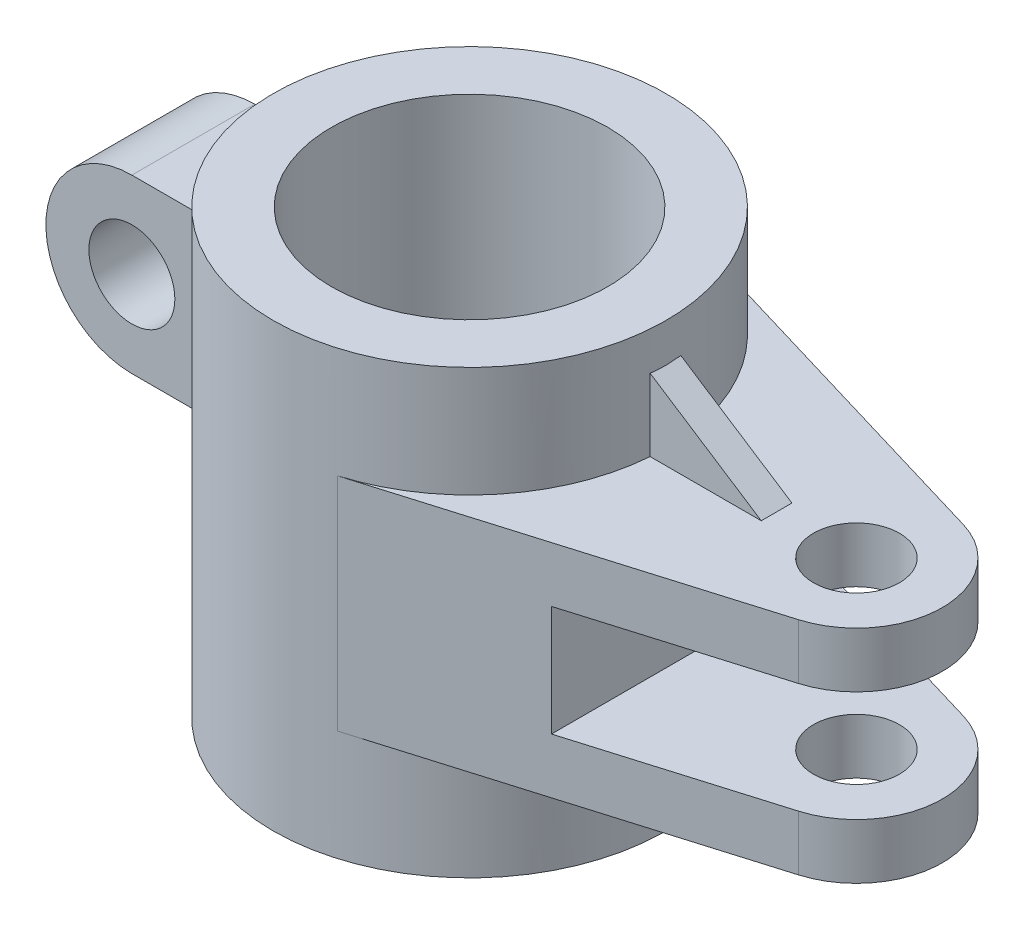
ISO-10303-21;
HEADER;
FILE_DESCRIPTION(('STEP AP214'),'2;1');
FILE_NAME('part.step','',(''),(''),'','','');
FILE_SCHEMA(('AUTOMOTIVE_DESIGN { 1 0 10303 214 1 1 1 1 }'));
ENDSEC;
DATA;
#1=APPLICATION_CONTEXT('core data for automotive mechanical design processes');
#2=APPLICATION_PROTOCOL_DEFINITION('international standard','automotive_design',2000,#1);
#3=PRODUCT_CONTEXT('',#1,'mechanical');
#4=PRODUCT('Part','Part','',(#3));
#5=PRODUCT_RELATED_PRODUCT_CATEGORY('part','',(#4));
#6=PRODUCT_DEFINITION_FORMATION('','',#4);
#7=PRODUCT_DEFINITION_CONTEXT('part definition',#1,'design');
#8=PRODUCT_DEFINITION('design','',#6,#7);
#9=PRODUCT_DEFINITION_SHAPE('','',#8);
#10=(LENGTH_UNIT() NAMED_UNIT(*) SI_UNIT(.MILLI.,.METRE.));
#11=(NAMED_UNIT(*) PLANE_ANGLE_UNIT() SI_UNIT($,.RADIAN.));
#12=(NAMED_UNIT(*) SI_UNIT($,.STERADIAN.) SOLID_ANGLE_UNIT());
#13=UNCERTAINTY_MEASURE_WITH_UNIT(LENGTH_MEASURE(1.E-05),#10,'distance_accuracy_value','');
#14=(GEOMETRIC_REPRESENTATION_CONTEXT(3) GLOBAL_UNCERTAINTY_ASSIGNED_CONTEXT((#13)) GLOBAL_UNIT_ASSIGNED_CONTEXT((#10,
#11,#12)) REPRESENTATION_CONTEXT('',''));
#15=CARTESIAN_POINT('',(0.,0.,0.));
#16=DIRECTION('',(0.,0.,1.));
#17=DIRECTION('',(1.,0.,0.));
#18=AXIS2_PLACEMENT_3D('',#15,#16,#17);
#19=CARTESIAN_POINT('',(0.,72.,0.));
#20=DIRECTION('',(0.,-1.,0.));
#21=DIRECTION('',(0.,0.,-1.));
#22=AXIS2_PLACEMENT_3D('',#19,#20,#21);
#23=CYLINDRICAL_SURFACE('',#22,32.);
#24=CARTESIAN_POINT('',(0.,72.,0.));
#25=DIRECTION('',(0.,1.,0.));
#26=DIRECTION('',(0.,0.,1.));
#27=AXIS2_PLACEMENT_3D('',#24,#25,#26);
#28=CIRCLE('',#27,32.);
#29=CARTESIAN_POINT('',(0.,72.,32.));
#30=VERTEX_POINT('',#29);
#31=EDGE_CURVE('E274',#30,#30,#28,.T.);
#32=ORIENTED_EDGE('',*,*,#31,.F.);
#33=EDGE_LOOP('',(#32));
#34=FACE_BOUND('',#33,.T.);
#35=CARTESIAN_POINT('',(0.,0.,0.));
#36=DIRECTION('',(0.,1.,0.));
#37=DIRECTION('',(0.,0.,1.));
#38=AXIS2_PLACEMENT_3D('',#35,#36,#37);
#39=CIRCLE('',#38,32.);
#40=CARTESIAN_POINT('',(0.,0.,32.));
#41=VERTEX_POINT('',#40);
#42=EDGE_CURVE('E271',#41,#41,#39,.T.);
#43=ORIENTED_EDGE('',*,*,#42,.T.);
#44=EDGE_LOOP('',(#43));
#45=FACE_BOUND('',#44,.T.);
#46=DIRECTION('',(0.,-1.,0.));
#47=VECTOR('',#46,1.);
#48=CARTESIAN_POINT('',(-30.3973683071413,72.,-10.));
#49=LINE('',#48,#47);
#50=CARTESIAN_POINT('',(-30.3973683071413,59.,-10.));
#51=VERTEX_POINT('',#50);
#52=CARTESIAN_POINT('',(-30.3973683071413,31.,-10.));
#53=VERTEX_POINT('',#52);
#54=EDGE_CURVE('E286',#51,#53,#49,.T.);
#55=ORIENTED_EDGE('',*,*,#54,.F.);
#56=CARTESIAN_POINT('',(0.,59.,0.));
#57=DIRECTION('',(0.,1.,0.));
#58=DIRECTION('',(0.,0.,1.));
#59=AXIS2_PLACEMENT_3D('',#56,#57,#58);
#60=CIRCLE('',#59,32.);
#61=CARTESIAN_POINT('',(-30.3973683071413,59.,10.));
#62=VERTEX_POINT('',#61);
#63=EDGE_CURVE('E292',#51,#62,#60,.T.);
#64=ORIENTED_EDGE('',*,*,#63,.T.);
#65=DIRECTION('',(0.,-1.,0.));
#66=VECTOR('',#65,1.);
#67=CARTESIAN_POINT('',(-30.3973683071413,72.,10.));
#68=LINE('',#67,#66);
#69=CARTESIAN_POINT('',(-30.3973683071413,31.,10.));
#70=VERTEX_POINT('',#69);
#71=EDGE_CURVE('E289',#70,#62,#68,.F.);
#72=ORIENTED_EDGE('',*,*,#71,.F.);
#73=CARTESIAN_POINT('',(0.,31.,0.));
#74=DIRECTION('',(0.,1.,0.));
#75=DIRECTION('',(0.,0.,1.));
#76=AXIS2_PLACEMENT_3D('',#73,#74,#75);
#77=CIRCLE('',#76,32.);
#78=EDGE_CURVE('E277',#53,#70,#77,.T.);
#79=ORIENTED_EDGE('',*,*,#78,.F.);
#80=EDGE_LOOP('',(#55,#64,#72,#79));
#81=FACE_BOUND('',#80,.T.);
#82=DIRECTION('',(0.,-1.,0.));
#83=VECTOR('',#82,1.);
#84=CARTESIAN_POINT('',(31.9021942818985,72.,2.5));
#85=LINE('',#84,#83);
#86=CARTESIAN_POINT('',(31.9021942818985,65.7528524535483,2.5));
#87=VERTEX_POINT('',#86);
#88=CARTESIAN_POINT('',(31.9021942818985,54.,2.5));
#89=VERTEX_POINT('',#88);
#90=EDGE_CURVE('E152',#87,#89,#85,.T.);
#91=ORIENTED_EDGE('',*,*,#90,.F.);
#92=CARTESIAN_POINT('',(0.,86.4703796598751,0.));
#93=DIRECTION('',(-0.544639035015022,-0.838670567945427,0.));
#94=DIRECTION('',(0.838670567945427,-0.544639035015022,0.));
#95=AXIS2_PLACEMENT_3D('',#92,#93,#94);
#96=ELLIPSE('',#95,38.1556253707502,32.);
#97=CARTESIAN_POINT('',(31.9021942818985,65.7528524535483,-2.5));
#98=VERTEX_POINT('',#97);
#99=EDGE_CURVE('E157',#98,#87,#96,.T.);
#100=ORIENTED_EDGE('',*,*,#99,.F.);
#101=DIRECTION('',(0.,-1.,0.));
#102=VECTOR('',#101,1.);
#103=CARTESIAN_POINT('',(31.9021942818985,72.,-2.5));
#104=LINE('',#103,#102);
#105=CARTESIAN_POINT('',(31.9021942818985,54.,-2.5));
#106=VERTEX_POINT('',#105);
#107=EDGE_CURVE('E163',#98,#106,#104,.T.);
#108=ORIENTED_EDGE('',*,*,#107,.T.);
#109=CARTESIAN_POINT('',(0.,54.,0.));
#110=DIRECTION('',(0.,-1.,0.));
#111=DIRECTION('',(0.,0.,-1.));
#112=AXIS2_PLACEMENT_3D('',#109,#110,#111);
#113=CIRCLE('',#112,32.);
#114=CARTESIAN_POINT('',(9.14285714285714,54.,-30.6660751199971));
#115=VERTEX_POINT('',#114);
#116=EDGE_CURVE('E233',#115,#106,#113,.T.);
#117=ORIENTED_EDGE('',*,*,#116,.F.);
#118=DIRECTION('',(0.,-1.,0.));
#119=VECTOR('',#118,1.);
#120=CARTESIAN_POINT('',(9.14285714285714,54.,-30.6660751199971));
#121=LINE('',#120,#119);
#122=CARTESIAN_POINT('',(9.14285714285713,18.,-30.6660751199971));
#123=VERTEX_POINT('',#122);
#124=EDGE_CURVE('E242',#115,#123,#121,.T.);
#125=ORIENTED_EDGE('',*,*,#124,.T.);
#126=CARTESIAN_POINT('',(0.,18.,0.));
#127=DIRECTION('',(0.,-1.,0.));
#128=DIRECTION('',(0.,0.,-1.));
#129=AXIS2_PLACEMENT_3D('',#126,#127,#128);
#130=CIRCLE('',#129,32.);
#131=CARTESIAN_POINT('',(9.14285714285714,18.,30.6660751199971));
#132=VERTEX_POINT('',#131);
#133=EDGE_CURVE('E228',#123,#132,#130,.T.);
#134=ORIENTED_EDGE('',*,*,#133,.T.);
#135=DIRECTION('',(0.,-1.,0.));
#136=VECTOR('',#135,1.);
#137=CARTESIAN_POINT('',(9.14285714285714,54.,30.6660751199971));
#138=LINE('',#137,#136);
#139=CARTESIAN_POINT('',(9.14285714285714,54.,30.6660751199971));
#140=VERTEX_POINT('',#139);
#141=EDGE_CURVE('E264',#140,#132,#138,.T.);
#142=ORIENTED_EDGE('',*,*,#141,.F.);
#143=EDGE_CURVE('E236',#89,#140,#113,.T.);
#144=ORIENTED_EDGE('',*,*,#143,.F.);
#145=EDGE_LOOP('',(#91,#100,#108,#117,#125,#134,#142,#144));
#146=FACE_BOUND('',#145,.T.);
#147=ADVANCED_FACE('F35',(#34,#45,#81,#146),#23,.T.);
#148=CARTESIAN_POINT('',(0.,54.,0.));
#149=DIRECTION('',(0.,-1.,0.));
#150=DIRECTION('',(0.,0.,-1.));
#151=AXIS2_PLACEMENT_3D('',#148,#149,#150);
#152=PLANE('',#151);
#153=CARTESIAN_POINT('',(63.,54.,0.));
#154=DIRECTION('',(0.,1.,0.));
#155=DIRECTION('',(0.,0.,1.));
#156=AXIS2_PLACEMENT_3D('',#153,#154,#155);
#157=CIRCLE('',#156,7.);
#158=CARTESIAN_POINT('',(63.,54.,7.));
#159=VERTEX_POINT('',#158);
#160=EDGE_CURVE('E225',#159,#159,#157,.T.);
#161=ORIENTED_EDGE('',*,*,#160,.F.);
#162=EDGE_LOOP('',(#161));
#163=FACE_BOUND('',#162,.T.);
#164=DIRECTION('',(1.,0.,0.));
#165=VECTOR('',#164,1.);
#166=CARTESIAN_POINT('',(0.,54.,2.5));
#167=LINE('',#166,#165);
#168=CARTESIAN_POINT('',(50.,54.,2.5));
#169=VERTEX_POINT('',#168);
#170=EDGE_CURVE('E11',#89,#169,#167,.T.);
#171=ORIENTED_EDGE('',*,*,#170,.F.);
#172=ORIENTED_EDGE('',*,*,#143,.T.);
#173=DIRECTION('',(0.95831484749991,0.,-0.285714285714285));
#174=VECTOR('',#173,1.);
#175=CARTESIAN_POINT('',(9.14285714285714,54.,30.6660751199971));
#176=LINE('',#175,#174);
#177=CARTESIAN_POINT('',(67.,54.,13.4164078649987));
#178=VERTEX_POINT('',#177);
#179=EDGE_CURVE('E235',#140,#178,#176,.T.);
#180=ORIENTED_EDGE('',*,*,#179,.T.);
#181=CARTESIAN_POINT('',(63.,54.,0.));
#182=DIRECTION('',(0.,1.,0.));
#183=DIRECTION('',(0.,0.,1.));
#184=AXIS2_PLACEMENT_3D('',#181,#182,#183);
#185=CIRCLE('',#184,14.);
#186=CARTESIAN_POINT('',(67.,54.,-13.4164078649987));
#187=VERTEX_POINT('',#186);
#188=EDGE_CURVE('E238',#178,#187,#185,.T.);
#189=ORIENTED_EDGE('',*,*,#188,.T.);
#190=DIRECTION('',(-0.95831484749991,0.,-0.285714285714285));
#191=VECTOR('',#190,1.);
#192=CARTESIAN_POINT('',(9.14285714285714,54.,-30.6660751199971));
#193=LINE('',#192,#191);
#194=EDGE_CURVE('E240',#187,#115,#193,.T.);
#195=ORIENTED_EDGE('',*,*,#194,.T.);
#196=ORIENTED_EDGE('',*,*,#116,.T.);
#197=DIRECTION('',(1.,0.,0.));
#198=VECTOR('',#197,1.);
#199=CARTESIAN_POINT('',(0.,54.,-2.5));
#200=LINE('',#199,#198);
#201=CARTESIAN_POINT('',(50.,54.,-2.5));
#202=VERTEX_POINT('',#201);
#203=EDGE_CURVE('E42',#106,#202,#200,.T.);
#204=ORIENTED_EDGE('',*,*,#203,.T.);
#205=DIRECTION('',(0.,0.,-1.));
#206=VECTOR('',#205,1.);
#207=CARTESIAN_POINT('',(50.,54.,2.5));
#208=LINE('',#207,#206);
#209=EDGE_CURVE('E49',#169,#202,#208,.T.);
#210=ORIENTED_EDGE('',*,*,#209,.F.);
#211=EDGE_LOOP('',(#171,#172,#180,#189,#195,#196,#204,#210));
#212=FACE_BOUND('',#211,.T.);
#213=ADVANCED_FACE('F161',(#163,#212),#152,.F.);
#214=CARTESIAN_POINT('',(-30.3305054874093,59.,10.));
#215=DIRECTION('',(0.,0.,-1.));
#216=DIRECTION('',(-1.,0.,0.));
#217=AXIS2_PLACEMENT_3D('',#214,#215,#216);
#218=PLANE('',#217);
#219=CARTESIAN_POINT('',(-45.,45.,9.99999999999999));
#220=DIRECTION('',(0.,0.,-1.));
#221=DIRECTION('',(-1.,0.,0.));
#222=AXIS2_PLACEMENT_3D('',#219,#220,#221);
#223=CIRCLE('',#222,7.);
#224=CARTESIAN_POINT('',(-52.,45.,10.));
#225=VERTEX_POINT('',#224);
#226=EDGE_CURVE('E183',#225,#225,#223,.T.);
#227=ORIENTED_EDGE('',*,*,#226,.T.);
#228=EDGE_LOOP('',(#227));
#229=FACE_BOUND('',#228,.T.);
#230=DIRECTION('',(1.,0.,0.));
#231=VECTOR('',#230,1.);
#232=CARTESIAN_POINT('',(-45.,59.,10.));
#233=LINE('',#232,#231);
#234=CARTESIAN_POINT('',(-45.,59.,9.99999999999999));
#235=VERTEX_POINT('',#234);
#236=EDGE_CURVE('E187',#235,#62,#233,.T.);
#237=ORIENTED_EDGE('',*,*,#236,.F.);
#238=CARTESIAN_POINT('',(-45.,45.,9.99999999999999));
#239=DIRECTION('',(0.,0.,-1.));
#240=DIRECTION('',(-1.,0.,0.));
#241=AXIS2_PLACEMENT_3D('',#238,#239,#240);
#242=CIRCLE('',#241,14.);
#243=CARTESIAN_POINT('',(-45.4248343700193,31.006447350367,10.));
#244=VERTEX_POINT('',#243);
#245=EDGE_CURVE('E178',#244,#235,#242,.T.);
#246=ORIENTED_EDGE('',*,*,#245,.F.);
#247=DIRECTION('',(-0.914920888233763,-0.403633210072639,0.));
#248=VECTOR('',#247,1.);
#249=CARTESIAN_POINT('',(-22.4518622668061,41.141372232047,9.99999999999999));
#250=LINE('',#249,#248);
#251=CARTESIAN_POINT('',(-45.4394486668049,31.,10.));
#252=VERTEX_POINT('',#251);
#253=EDGE_CURVE('E175',#244,#252,#250,.T.);
#254=ORIENTED_EDGE('',*,*,#253,.T.);
#255=DIRECTION('',(1.,0.,0.));
#256=VECTOR('',#255,1.);
#257=CARTESIAN_POINT('',(-30.3305054874093,31.,10.));
#258=LINE('',#257,#256);
#259=EDGE_CURVE('E186',#252,#70,#258,.T.);
#260=ORIENTED_EDGE('',*,*,#259,.T.);
#261=ORIENTED_EDGE('',*,*,#71,.T.);
#262=EDGE_LOOP('',(#237,#246,#254,#260,#261));
#263=FACE_BOUND('',#262,.T.);
#264=ADVANCED_FACE('F310',(#229,#263),#218,.F.);
#265=CARTESIAN_POINT('',(-45.,59.,-10.));
#266=DIRECTION('',(0.,0.,1.));
#267=DIRECTION('',(1.,0.,0.));
#268=AXIS2_PLACEMENT_3D('',#265,#266,#267);
#269=PLANE('',#268);
#270=CARTESIAN_POINT('',(-45.,45.,-10.));
#271=DIRECTION('',(0.,0.,1.));
#272=DIRECTION('',(1.,0.,0.));
#273=AXIS2_PLACEMENT_3D('',#270,#271,#272);
#274=CIRCLE('',#273,7.);
#275=CARTESIAN_POINT('',(-38.,45.,-10.));
#276=VERTEX_POINT('',#275);
#277=EDGE_CURVE('E181',#276,#276,#274,.T.);
#278=ORIENTED_EDGE('',*,*,#277,.T.);
#279=EDGE_LOOP('',(#278));
#280=FACE_BOUND('',#279,.T.);
#281=CARTESIAN_POINT('',(-45.,45.,-10.));
#282=DIRECTION('',(0.,0.,1.));
#283=DIRECTION('',(1.,0.,0.));
#284=AXIS2_PLACEMENT_3D('',#281,#282,#283);
#285=CIRCLE('',#284,14.);
#286=CARTESIAN_POINT('',(-45.,59.,-10.));
#287=VERTEX_POINT('',#286);
#288=CARTESIAN_POINT('',(-45.4248343700193,31.006447350367,-10.));
#289=VERTEX_POINT('',#288);
#290=EDGE_CURVE('E179',#287,#289,#285,.T.);
#291=ORIENTED_EDGE('',*,*,#290,.F.);
#292=DIRECTION('',(-1.,0.,0.));
#293=VECTOR('',#292,1.);
#294=CARTESIAN_POINT('',(-30.3305054874093,59.,-10.));
#295=LINE('',#294,#293);
#296=EDGE_CURVE('E189',#51,#287,#295,.T.);
#297=ORIENTED_EDGE('',*,*,#296,.F.);
#298=ORIENTED_EDGE('',*,*,#54,.T.);
#299=DIRECTION('',(-1.,0.,0.));
#300=VECTOR('',#299,1.);
#301=CARTESIAN_POINT('',(-45.,31.,-10.));
#302=LINE('',#301,#300);
#303=CARTESIAN_POINT('',(-45.4394486668049,31.,-10.));
#304=VERTEX_POINT('',#303);
#305=EDGE_CURVE('E190',#53,#304,#302,.T.);
#306=ORIENTED_EDGE('',*,*,#305,.T.);
#307=DIRECTION('',(0.914920888233763,0.403633210072639,0.));
#308=VECTOR('',#307,1.);
#309=CARTESIAN_POINT('',(-34.7314061327155,35.7240385887053,-10.));
#310=LINE('',#309,#308);
#311=EDGE_CURVE('E57',#304,#289,#310,.T.);
#312=ORIENTED_EDGE('',*,*,#311,.T.);
#313=EDGE_LOOP('',(#291,#297,#298,#306,#312));
#314=FACE_BOUND('',#313,.T.);
#315=ADVANCED_FACE('F319',(#280,#314),#269,.F.);
#316=CARTESIAN_POINT('',(0.,59.,0.));
#317=DIRECTION('',(0.,1.,0.));
#318=DIRECTION('',(0.,0.,1.));
#319=AXIS2_PLACEMENT_3D('',#316,#317,#318);
#320=PLANE('',#319);
#321=ORIENTED_EDGE('',*,*,#296,.T.);
#322=DIRECTION('',(0.,0.,1.));
#323=VECTOR('',#322,1.);
#324=CARTESIAN_POINT('',(-45.,59.,-32.));
#325=LINE('',#324,#323);
#326=EDGE_CURVE('E299',#287,#235,#325,.T.);
#327=ORIENTED_EDGE('',*,*,#326,.T.);
#328=ORIENTED_EDGE('',*,*,#236,.T.);
#329=ORIENTED_EDGE('',*,*,#63,.F.);
#330=EDGE_LOOP('',(#321,#327,#328,#329));
#331=FACE_BOUND('',#330,.T.);
#332=ADVANCED_FACE('F303',(#331),#320,.T.);
#333=CARTESIAN_POINT('',(9.14285714285714,54.,30.6660751199971));
#334=DIRECTION('',(-0.285714285714285,0.,-0.95831484749991));
#335=DIRECTION('',(-0.95831484749991,0.,0.285714285714286));
#336=AXIS2_PLACEMENT_3D('',#333,#334,#335);
#337=PLANE('',#336);
#338=DIRECTION('',(0.95831484749991,0.,-0.285714285714285));
#339=VECTOR('',#338,1.);
#340=CARTESIAN_POINT('',(36.,27.,22.6588221719979));
#341=LINE('',#340,#339);
#342=CARTESIAN_POINT('',(36.,27.,22.6588221719979));
#343=VERTEX_POINT('',#342);
#344=CARTESIAN_POINT('',(67.,27.,13.4164078649987));
#345=VERTEX_POINT('',#344);
#346=EDGE_CURVE('E204',#343,#345,#341,.T.);
#347=ORIENTED_EDGE('',*,*,#346,.F.);
#348=DIRECTION('',(0.,1.,0.));
#349=VECTOR('',#348,1.);
#350=CARTESIAN_POINT('',(36.,27.,22.6588221719979));
#351=LINE('',#350,#349);
#352=CARTESIAN_POINT('',(36.,45.,22.6588221719979));
#353=VERTEX_POINT('',#352);
#354=EDGE_CURVE('E219',#343,#353,#351,.T.);
#355=ORIENTED_EDGE('',*,*,#354,.T.);
#356=DIRECTION('',(0.95831484749991,0.,-0.285714285714285));
#357=VECTOR('',#356,1.);
#358=CARTESIAN_POINT('',(36.,45.,22.6588221719979));
#359=LINE('',#358,#357);
#360=CARTESIAN_POINT('',(67.,45.,13.4164078649987));
#361=VERTEX_POINT('',#360);
#362=EDGE_CURVE('E214',#353,#361,#359,.T.);
#363=ORIENTED_EDGE('',*,*,#362,.T.);
#364=DIRECTION('',(0.,-1.,0.));
#365=VECTOR('',#364,1.);
#366=CARTESIAN_POINT('',(67.,54.,13.4164078649987));
#367=LINE('',#366,#365);
#368=EDGE_CURVE('E261',#178,#361,#367,.T.);
#369=ORIENTED_EDGE('',*,*,#368,.F.);
#370=ORIENTED_EDGE('',*,*,#179,.F.);
#371=ORIENTED_EDGE('',*,*,#141,.T.);
#372=DIRECTION('',(0.95831484749991,0.,-0.285714285714285));
#373=VECTOR('',#372,1.);
#374=CARTESIAN_POINT('',(9.14285714285714,18.,30.6660751199971));
#375=LINE('',#374,#373);
#376=CARTESIAN_POINT('',(67.,18.,13.4164078649987));
#377=VERTEX_POINT('',#376);
#378=EDGE_CURVE('E245',#132,#377,#375,.T.);
#379=ORIENTED_EDGE('',*,*,#378,.T.);
#380=EDGE_CURVE('E260',#345,#377,#367,.T.);
#381=ORIENTED_EDGE('',*,*,#380,.F.);
#382=EDGE_LOOP('',(#347,#355,#363,#369,#370,#371,#379,#381));
#383=FACE_BOUND('',#382,.T.);
#384=ADVANCED_FACE('F362',(#383),#337,.F.);
#385=CARTESIAN_POINT('',(63.,54.,0.));
#386=DIRECTION('',(0.,-1.,0.));
#387=DIRECTION('',(0.,0.,-1.));
#388=AXIS2_PLACEMENT_3D('',#385,#386,#387);
#389=CYLINDRICAL_SURFACE('',#388,14.);
#390=CARTESIAN_POINT('',(63.,27.,0.));
#391=DIRECTION('',(0.,1.,0.));
#392=DIRECTION('',(0.,0.,1.));
#393=AXIS2_PLACEMENT_3D('',#390,#391,#392);
#394=CIRCLE('',#393,14.);
#395=CARTESIAN_POINT('',(67.,27.,-13.4164078649987));
#396=VERTEX_POINT('',#395);
#397=EDGE_CURVE('E206',#345,#396,#394,.T.);
#398=ORIENTED_EDGE('',*,*,#397,.F.);
#399=ORIENTED_EDGE('',*,*,#380,.T.);
#400=CARTESIAN_POINT('',(63.,18.,0.));
#401=DIRECTION('',(0.,1.,0.));
#402=DIRECTION('',(0.,0.,1.));
#403=AXIS2_PLACEMENT_3D('',#400,#401,#402);
#404=CIRCLE('',#403,14.);
#405=CARTESIAN_POINT('',(67.,18.,-13.4164078649987));
#406=VERTEX_POINT('',#405);
#407=EDGE_CURVE('E248',#377,#406,#404,.T.);
#408=ORIENTED_EDGE('',*,*,#407,.T.);
#409=DIRECTION('',(0.,-1.,0.));
#410=VECTOR('',#409,1.);
#411=CARTESIAN_POINT('',(67.,54.,-13.4164078649987));
#412=LINE('',#411,#410);
#413=EDGE_CURVE('E256',#396,#406,#412,.T.);
#414=ORIENTED_EDGE('',*,*,#413,.F.);
#415=EDGE_LOOP('',(#398,#399,#408,#414));
#416=FACE_BOUND('',#415,.T.);
#417=ADVANCED_FACE('F379',(#416),#389,.T.);
#418=CARTESIAN_POINT('',(9.14285714285714,54.,-30.6660751199971));
#419=DIRECTION('',(-0.285714285714285,0.,0.95831484749991));
#420=DIRECTION('',(0.95831484749991,0.,0.285714285714286));
#421=AXIS2_PLACEMENT_3D('',#418,#419,#420);
#422=PLANE('',#421);
#423=DIRECTION('',(-0.95831484749991,0.,-0.285714285714285));
#424=VECTOR('',#423,1.);
#425=CARTESIAN_POINT('',(36.,27.,-22.6588221719979));
#426=LINE('',#425,#424);
#427=CARTESIAN_POINT('',(36.,27.,-22.6588221719979));
#428=VERTEX_POINT('',#427);
#429=EDGE_CURVE('E197',#396,#428,#426,.T.);
#430=ORIENTED_EDGE('',*,*,#429,.F.);
#431=ORIENTED_EDGE('',*,*,#413,.T.);
#432=DIRECTION('',(-0.95831484749991,0.,-0.285714285714285));
#433=VECTOR('',#432,1.);
#434=CARTESIAN_POINT('',(9.14285714285714,18.,-30.6660751199971));
#435=LINE('',#434,#433);
#436=EDGE_CURVE('E251',#406,#123,#435,.T.);
#437=ORIENTED_EDGE('',*,*,#436,.T.);
#438=ORIENTED_EDGE('',*,*,#124,.F.);
#439=ORIENTED_EDGE('',*,*,#194,.F.);
#440=CARTESIAN_POINT('',(67.,45.,-13.4164078649987));
#441=VERTEX_POINT('',#440);
#442=EDGE_CURVE('E257',#187,#441,#412,.T.);
#443=ORIENTED_EDGE('',*,*,#442,.T.);
#444=DIRECTION('',(-0.95831484749991,0.,-0.285714285714285));
#445=VECTOR('',#444,1.);
#446=CARTESIAN_POINT('',(36.,45.,-22.6588221719979));
#447=LINE('',#446,#445);
#448=CARTESIAN_POINT('',(36.,45.,-22.6588221719979));
#449=VERTEX_POINT('',#448);
#450=EDGE_CURVE('E193',#441,#449,#447,.T.);
#451=ORIENTED_EDGE('',*,*,#450,.T.);
#452=DIRECTION('',(0.,1.,0.));
#453=VECTOR('',#452,1.);
#454=CARTESIAN_POINT('',(36.,27.,-22.6588221719979));
#455=LINE('',#454,#453);
#456=EDGE_CURVE('E208',#428,#449,#455,.T.);
#457=ORIENTED_EDGE('',*,*,#456,.F.);
#458=EDGE_LOOP('',(#430,#431,#437,#438,#439,#443,#451,#457));
#459=FACE_BOUND('',#458,.T.);
#460=ADVANCED_FACE('F370',(#459),#422,.F.);
#461=CARTESIAN_POINT('',(63.,54.,0.));
#462=DIRECTION('',(0.,-1.,0.));
#463=DIRECTION('',(0.,0.,-1.));
#464=AXIS2_PLACEMENT_3D('',#461,#462,#463);
#465=CYLINDRICAL_SURFACE('',#464,7.);
#466=CARTESIAN_POINT('',(63.,18.,0.));
#467=DIRECTION('',(0.,1.,0.));
#468=DIRECTION('',(0.,0.,1.));
#469=AXIS2_PLACEMENT_3D('',#466,#467,#468);
#470=CIRCLE('',#469,7.);
#471=CARTESIAN_POINT('',(63.,18.,7.));
#472=VERTEX_POINT('',#471);
#473=EDGE_CURVE('E229',#472,#472,#470,.T.);
#474=ORIENTED_EDGE('',*,*,#473,.F.);
#475=EDGE_LOOP('',(#474));
#476=FACE_BOUND('',#475,.T.);
#477=CARTESIAN_POINT('',(63.,27.,0.));
#478=DIRECTION('',(0.,1.,0.));
#479=DIRECTION('',(0.,0.,1.));
#480=AXIS2_PLACEMENT_3D('',#477,#478,#479);
#481=CIRCLE('',#480,7.);
#482=CARTESIAN_POINT('',(63.,27.,7.));
#483=VERTEX_POINT('',#482);
#484=EDGE_CURVE('E232',#483,#483,#481,.T.);
#485=ORIENTED_EDGE('',*,*,#484,.T.);
#486=EDGE_LOOP('',(#485));
#487=FACE_BOUND('',#486,.T.);
#488=ADVANCED_FACE('F365',(#476,#487),#465,.F.);
#489=CARTESIAN_POINT('',(0.,72.,0.));
#490=DIRECTION('',(0.,1.,0.));
#491=DIRECTION('',(0.,0.,1.));
#492=AXIS2_PLACEMENT_3D('',#489,#490,#491);
#493=PLANE('',#492);
#494=ORIENTED_EDGE('',*,*,#31,.T.);
#495=EDGE_LOOP('',(#494));
#496=FACE_BOUND('',#495,.T.);
#497=CARTESIAN_POINT('',(0.,72.,0.));
#498=DIRECTION('',(0.,1.,0.));
#499=DIRECTION('',(0.,0.,1.));
#500=AXIS2_PLACEMENT_3D('',#497,#498,#499);
#501=CIRCLE('',#500,22.5);
#502=CARTESIAN_POINT('',(0.,72.,22.5));
#503=VERTEX_POINT('',#502);
#504=EDGE_CURVE('E268',#503,#503,#501,.T.);
#505=ORIENTED_EDGE('',*,*,#504,.F.);
#506=EDGE_LOOP('',(#505));
#507=FACE_BOUND('',#506,.T.);
#508=ADVANCED_FACE('F347',(#496,#507),#493,.T.);
#509=CARTESIAN_POINT('',(0.,0.,0.));
#510=DIRECTION('',(0.,1.,0.));
#511=DIRECTION('',(0.,0.,1.));
#512=AXIS2_PLACEMENT_3D('',#509,#510,#511);
#513=PLANE('',#512);
#514=ORIENTED_EDGE('',*,*,#42,.F.);
#515=EDGE_LOOP('',(#514));
#516=FACE_BOUND('',#515,.T.);
#517=CARTESIAN_POINT('',(0.,0.,0.));
#518=DIRECTION('',(0.,1.,0.));
#519=DIRECTION('',(0.,0.,1.));
#520=AXIS2_PLACEMENT_3D('',#517,#518,#519);
#521=CIRCLE('',#520,22.5);
#522=CARTESIAN_POINT('',(0.,0.,22.5));
#523=VERTEX_POINT('',#522);
#524=EDGE_CURVE('E267',#523,#523,#521,.T.);
#525=ORIENTED_EDGE('',*,*,#524,.T.);
#526=EDGE_LOOP('',(#525));
#527=FACE_BOUND('',#526,.T.);
#528=ADVANCED_FACE('F343',(#516,#527),#513,.F.);
#529=CARTESIAN_POINT('',(0.,72.,0.));
#530=DIRECTION('',(0.,-1.,0.));
#531=DIRECTION('',(0.,0.,-1.));
#532=AXIS2_PLACEMENT_3D('',#529,#530,#531);
#533=CYLINDRICAL_SURFACE('',#532,22.5);
#534=ORIENTED_EDGE('',*,*,#504,.T.);
#535=EDGE_LOOP('',(#534));
#536=FACE_BOUND('',#535,.T.);
#537=ORIENTED_EDGE('',*,*,#524,.F.);
#538=EDGE_LOOP('',(#537));
#539=FACE_BOUND('',#538,.T.);
#540=ADVANCED_FACE('F346',(#536,#539),#533,.F.);
#541=CARTESIAN_POINT('',(0.,18.,0.));
#542=DIRECTION('',(0.,-1.,0.));
#543=DIRECTION('',(0.,0.,-1.));
#544=AXIS2_PLACEMENT_3D('',#541,#542,#543);
#545=PLANE('',#544);
#546=ORIENTED_EDGE('',*,*,#133,.F.);
#547=ORIENTED_EDGE('',*,*,#436,.F.);
#548=ORIENTED_EDGE('',*,*,#407,.F.);
#549=ORIENTED_EDGE('',*,*,#378,.F.);
#550=EDGE_LOOP('',(#546,#547,#548,#549));
#551=FACE_BOUND('',#550,.T.);
#552=ORIENTED_EDGE('',*,*,#473,.T.);
#553=EDGE_LOOP('',(#552));
#554=FACE_BOUND('',#553,.T.);
#555=ADVANCED_FACE('F351',(#551,#554),#545,.T.);
#556=ORIENTED_EDGE('',*,*,#368,.T.);
#557=CARTESIAN_POINT('',(63.,45.,0.));
#558=DIRECTION('',(0.,1.,0.));
#559=DIRECTION('',(0.,0.,1.));
#560=AXIS2_PLACEMENT_3D('',#557,#558,#559);
#561=CIRCLE('',#560,14.);
#562=EDGE_CURVE('E201',#361,#441,#561,.T.);
#563=ORIENTED_EDGE('',*,*,#562,.T.);
#564=ORIENTED_EDGE('',*,*,#442,.F.);
#565=ORIENTED_EDGE('',*,*,#188,.F.);
#566=EDGE_LOOP('',(#556,#563,#564,#565));
#567=FACE_BOUND('',#566,.T.);
#568=ADVANCED_FACE('F357',(#567),#389,.T.);
#569=CARTESIAN_POINT('',(63.,45.,0.));
#570=DIRECTION('',(0.,1.,0.));
#571=DIRECTION('',(0.,0.,1.));
#572=AXIS2_PLACEMENT_3D('',#569,#570,#571);
#573=CIRCLE('',#572,7.);
#574=CARTESIAN_POINT('',(63.,45.,7.));
#575=VERTEX_POINT('',#574);
#576=EDGE_CURVE('E222',#575,#575,#573,.T.);
#577=ORIENTED_EDGE('',*,*,#576,.F.);
#578=EDGE_LOOP('',(#577));
#579=FACE_BOUND('',#578,.T.);
#580=ORIENTED_EDGE('',*,*,#160,.T.);
#581=EDGE_LOOP('',(#580));
#582=FACE_BOUND('',#581,.T.);
#583=ADVANCED_FACE('F373',(#579,#582),#465,.F.);
#584=CARTESIAN_POINT('',(36.,27.,-22.6588221719979));
#585=DIRECTION('',(-1.,0.,0.));
#586=DIRECTION('',(0.,0.,1.));
#587=AXIS2_PLACEMENT_3D('',#584,#585,#586);
#588=PLANE('',#587);
#589=DIRECTION('',(0.,0.,1.));
#590=VECTOR('',#589,1.);
#591=CARTESIAN_POINT('',(36.,45.,-22.6588221719979));
#592=LINE('',#591,#590);
#593=EDGE_CURVE('E211',#449,#353,#592,.T.);
#594=ORIENTED_EDGE('',*,*,#593,.T.);
#595=ORIENTED_EDGE('',*,*,#354,.F.);
#596=DIRECTION('',(0.,0.,1.));
#597=VECTOR('',#596,1.);
#598=CARTESIAN_POINT('',(36.,27.,-22.6588221719979));
#599=LINE('',#598,#597);
#600=EDGE_CURVE('E200',#428,#343,#599,.T.);
#601=ORIENTED_EDGE('',*,*,#600,.F.);
#602=ORIENTED_EDGE('',*,*,#456,.T.);
#603=EDGE_LOOP('',(#594,#595,#601,#602));
#604=FACE_BOUND('',#603,.T.);
#605=ADVANCED_FACE('F386',(#604),#588,.F.);
#606=CARTESIAN_POINT('',(63.,27.,0.));
#607=DIRECTION('',(0.,1.,0.));
#608=DIRECTION('',(0.,0.,1.));
#609=AXIS2_PLACEMENT_3D('',#606,#607,#608);
#610=PLANE('',#609);
#611=ORIENTED_EDGE('',*,*,#484,.F.);
#612=EDGE_LOOP('',(#611));
#613=FACE_BOUND('',#612,.T.);
#614=ORIENTED_EDGE('',*,*,#429,.T.);
#615=ORIENTED_EDGE('',*,*,#600,.T.);
#616=ORIENTED_EDGE('',*,*,#346,.T.);
#617=ORIENTED_EDGE('',*,*,#397,.T.);
#618=EDGE_LOOP('',(#614,#615,#616,#617));
#619=FACE_BOUND('',#618,.T.);
#620=ADVANCED_FACE('F392',(#613,#619),#610,.T.);
#621=CARTESIAN_POINT('',(63.,45.,0.));
#622=DIRECTION('',(0.,1.,0.));
#623=DIRECTION('',(0.,0.,1.));
#624=AXIS2_PLACEMENT_3D('',#621,#622,#623);
#625=PLANE('',#624);
#626=ORIENTED_EDGE('',*,*,#576,.T.);
#627=EDGE_LOOP('',(#626));
#628=FACE_BOUND('',#627,.T.);
#629=ORIENTED_EDGE('',*,*,#450,.F.);
#630=ORIENTED_EDGE('',*,*,#562,.F.);
#631=ORIENTED_EDGE('',*,*,#362,.F.);
#632=ORIENTED_EDGE('',*,*,#593,.F.);
#633=EDGE_LOOP('',(#629,#630,#631,#632));
#634=FACE_BOUND('',#633,.T.);
#635=ADVANCED_FACE('F399',(#628,#634),#625,.F.);
#636=CARTESIAN_POINT('',(0.,31.,0.));
#637=DIRECTION('',(0.,1.,0.));
#638=DIRECTION('',(0.,0.,1.));
#639=AXIS2_PLACEMENT_3D('',#636,#637,#638);
#640=PLANE('',#639);
#641=ORIENTED_EDGE('',*,*,#259,.F.);
#642=DIRECTION('',(0.,0.,-1.));
#643=VECTOR('',#642,1.);
#644=CARTESIAN_POINT('',(-45.4394486668049,31.,0.));
#645=LINE('',#644,#643);
#646=EDGE_CURVE('E295',#252,#304,#645,.T.);
#647=ORIENTED_EDGE('',*,*,#646,.T.);
#648=ORIENTED_EDGE('',*,*,#305,.F.);
#649=ORIENTED_EDGE('',*,*,#78,.T.);
#650=EDGE_LOOP('',(#641,#647,#648,#649));
#651=FACE_BOUND('',#650,.T.);
#652=ADVANCED_FACE('F317',(#651),#640,.F.);
#653=CARTESIAN_POINT('',(-45.,45.,-32.));
#654=DIRECTION('',(0.,0.,1.));
#655=DIRECTION('',(1.,0.,0.));
#656=AXIS2_PLACEMENT_3D('',#653,#654,#655);
#657=CYLINDRICAL_SURFACE('',#656,7.);
#658=ORIENTED_EDGE('',*,*,#277,.F.);
#659=EDGE_LOOP('',(#658));
#660=FACE_BOUND('',#659,.T.);
#661=ORIENTED_EDGE('',*,*,#226,.F.);
#662=EDGE_LOOP('',(#661));
#663=FACE_BOUND('',#662,.T.);
#664=ADVANCED_FACE('F329',(#660,#663),#657,.F.);
#665=CARTESIAN_POINT('',(-45.,45.,-32.));
#666=DIRECTION('',(0.,0.,1.));
#667=DIRECTION('',(1.,0.,0.));
#668=AXIS2_PLACEMENT_3D('',#665,#666,#667);
#669=CYLINDRICAL_SURFACE('',#668,14.);
#670=ORIENTED_EDGE('',*,*,#245,.T.);
#671=ORIENTED_EDGE('',*,*,#326,.F.);
#672=ORIENTED_EDGE('',*,*,#290,.T.);
#673=DIRECTION('',(0.,0.,1.));
#674=VECTOR('',#673,1.);
#675=CARTESIAN_POINT('',(-45.4248343700193,31.006447350367,-32.));
#676=LINE('',#675,#674);
#677=EDGE_CURVE('E171',#289,#244,#676,.T.);
#678=ORIENTED_EDGE('',*,*,#677,.T.);
#679=EDGE_LOOP('',(#670,#671,#672,#678));
#680=FACE_BOUND('',#679,.T.);
#681=ADVANCED_FACE('F320',(#680),#669,.T.);
#682=CARTESIAN_POINT('',(-67.71509394659,21.1727129346928,-32.));
#683=DIRECTION('',(0.403633210072639,-0.914920888233763,0.));
#684=DIRECTION('',(0.914920888233763,0.403633210072639,0.));
#685=AXIS2_PLACEMENT_3D('',#682,#683,#684);
#686=PLANE('',#685);
#687=ORIENTED_EDGE('',*,*,#677,.F.);
#688=ORIENTED_EDGE('',*,*,#311,.F.);
#689=ORIENTED_EDGE('',*,*,#646,.F.);
#690=ORIENTED_EDGE('',*,*,#253,.F.);
#691=EDGE_LOOP('',(#687,#688,#689,#690));
#692=FACE_BOUND('',#691,.T.);
#693=ADVANCED_FACE('F321',(#692),#686,.F.);
#694=CARTESIAN_POINT('',(50.,54.,2.5));
#695=DIRECTION('',(-0.544639035015022,-0.838670567945427,0.));
#696=DIRECTION('',(0.838670567945427,-0.544639035015022,0.));
#697=AXIS2_PLACEMENT_3D('',#694,#695,#696);
#698=PLANE('',#697);
#699=DIRECTION('',(-0.838670567945427,0.544639035015022,0.));
#700=VECTOR('',#699,1.);
#701=CARTESIAN_POINT('',(50.,54.,-2.5));
#702=LINE('',#701,#700);
#703=EDGE_CURVE('E158',#202,#98,#702,.T.);
#704=ORIENTED_EDGE('',*,*,#703,.T.);
#705=ORIENTED_EDGE('',*,*,#99,.T.);
#706=DIRECTION('',(-0.838670567945427,0.544639035015022,0.));
#707=VECTOR('',#706,1.);
#708=CARTESIAN_POINT('',(50.,54.,2.5));
#709=LINE('',#708,#707);
#710=EDGE_CURVE('E150',#169,#87,#709,.T.);
#711=ORIENTED_EDGE('',*,*,#710,.F.);
#712=ORIENTED_EDGE('',*,*,#209,.T.);
#713=EDGE_LOOP('',(#704,#705,#711,#712));
#714=FACE_BOUND('',#713,.T.);
#715=ADVANCED_FACE('F155',(#714),#698,.F.);
#716=CARTESIAN_POINT('',(0.,0.,2.5));
#717=DIRECTION('',(0.,0.,-1.));
#718=DIRECTION('',(-1.,0.,0.));
#719=AXIS2_PLACEMENT_3D('',#716,#717,#718);
#720=PLANE('',#719);
#721=ORIENTED_EDGE('',*,*,#710,.T.);
#722=ORIENTED_EDGE('',*,*,#90,.T.);
#723=ORIENTED_EDGE('',*,*,#170,.T.);
#724=EDGE_LOOP('',(#721,#722,#723));
#725=FACE_BOUND('',#724,.T.);
#726=ADVANCED_FACE('F149',(#725),#720,.F.);
#727=CARTESIAN_POINT('',(0.,0.,-2.5));
#728=DIRECTION('',(0.,0.,-1.));
#729=DIRECTION('',(-1.,0.,0.));
#730=AXIS2_PLACEMENT_3D('',#727,#728,#729);
#731=PLANE('',#730);
#732=ORIENTED_EDGE('',*,*,#107,.F.);
#733=ORIENTED_EDGE('',*,*,#703,.F.);
#734=ORIENTED_EDGE('',*,*,#203,.F.);
#735=EDGE_LOOP('',(#732,#733,#734));
#736=FACE_BOUND('',#735,.T.);
#737=ADVANCED_FACE('F424',(#736),#731,.T.);
#738=CLOSED_SHELL('',(#147,#213,#264,#315,#332,#384,#417,#460,#488,#508,#528,#540,#555,#568,
#583,#605,#620,#635,#652,#664,#681,#693,#715,#726,#737));
#739=MANIFOLD_SOLID_BREP('B2',#738);
#740=ADVANCED_BREP_SHAPE_REPRESENTATION('',(#18,#739),#14);
#741=SHAPE_DEFINITION_REPRESENTATION(#9,#740);
ENDSEC;
END-ISO-10303-21;
